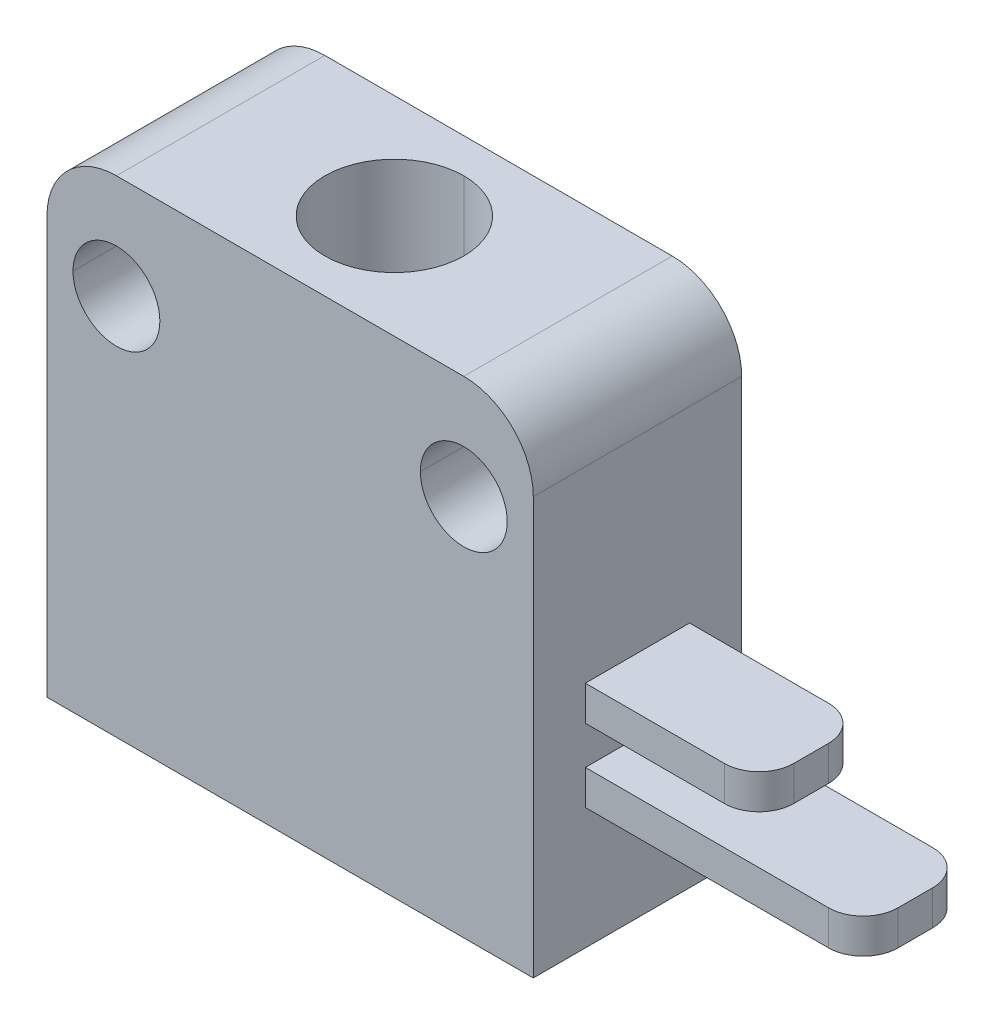
ISO-10303-21;
HEADER;
FILE_DESCRIPTION(('STEP AP214'),'2;1');
FILE_NAME('part.step','',(''),(''),'','','');
FILE_SCHEMA(('AUTOMOTIVE_DESIGN { 1 0 10303 214 1 1 1 1 }'));
ENDSEC;
DATA;
#1=APPLICATION_CONTEXT('core data for automotive mechanical design processes');
#2=APPLICATION_PROTOCOL_DEFINITION('international standard','automotive_design',2000,#1);
#3=PRODUCT_CONTEXT('',#1,'mechanical');
#4=PRODUCT('Part','Part','',(#3));
#5=PRODUCT_RELATED_PRODUCT_CATEGORY('part','',(#4));
#6=PRODUCT_DEFINITION_FORMATION('','',#4);
#7=PRODUCT_DEFINITION_CONTEXT('part definition',#1,'design');
#8=PRODUCT_DEFINITION('design','',#6,#7);
#9=PRODUCT_DEFINITION_SHAPE('','',#8);
#10=(LENGTH_UNIT() NAMED_UNIT(*) SI_UNIT(.MILLI.,.METRE.));
#11=(NAMED_UNIT(*) PLANE_ANGLE_UNIT() SI_UNIT($,.RADIAN.));
#12=(NAMED_UNIT(*) SI_UNIT($,.STERADIAN.) SOLID_ANGLE_UNIT());
#13=UNCERTAINTY_MEASURE_WITH_UNIT(LENGTH_MEASURE(1.E-05),#10,'distance_accuracy_value','');
#14=(GEOMETRIC_REPRESENTATION_CONTEXT(3) GLOBAL_UNCERTAINTY_ASSIGNED_CONTEXT((#13)) GLOBAL_UNIT_ASSIGNED_CONTEXT((#10,
#11,#12)) REPRESENTATION_CONTEXT('',''));
#15=CARTESIAN_POINT('',(0.,0.,0.));
#16=DIRECTION('',(0.,0.,1.));
#17=DIRECTION('',(1.,0.,0.));
#18=AXIS2_PLACEMENT_3D('',#15,#16,#17);
#19=CARTESIAN_POINT('',(11.,-7.4,-0.5));
#20=DIRECTION('',(0.,1.,0.));
#21=DIRECTION('',(-1.,0.,0.));
#22=AXIS2_PLACEMENT_3D('',#19,#20,#21);
#23=CYLINDRICAL_SURFACE('',#22,1.);
#24=CARTESIAN_POINT('',(11.,-8.4,-0.5));
#25=DIRECTION('',(0.,-1.,0.));
#26=DIRECTION('',(-1.,0.,0.));
#27=AXIS2_PLACEMENT_3D('',#24,#25,#26);
#28=CIRCLE('',#27,1.);
#29=CARTESIAN_POINT('',(11.,-8.4,-1.5));
#30=VERTEX_POINT('',#29);
#31=CARTESIAN_POINT('',(12.,-8.4,-0.5));
#32=VERTEX_POINT('',#31);
#33=EDGE_CURVE('E406',#30,#32,#28,.T.);
#34=ORIENTED_EDGE('',*,*,#33,.F.);
#35=DIRECTION('',(0.,-1.,0.));
#36=VECTOR('',#35,1.);
#37=CARTESIAN_POINT('',(11.,0.,-1.5));
#38=LINE('',#37,#36);
#39=CARTESIAN_POINT('',(11.,-7.4,-1.5));
#40=VERTEX_POINT('',#39);
#41=EDGE_CURVE('E265',#40,#30,#38,.T.);
#42=ORIENTED_EDGE('',*,*,#41,.F.);
#43=CARTESIAN_POINT('',(11.,-7.4,-0.5));
#44=DIRECTION('',(0.,1.,0.));
#45=DIRECTION('',(1.,0.,0.));
#46=AXIS2_PLACEMENT_3D('',#43,#44,#45);
#47=CIRCLE('',#46,1.);
#48=CARTESIAN_POINT('',(12.,-7.4,-0.5));
#49=VERTEX_POINT('',#48);
#50=EDGE_CURVE('E303',#49,#40,#47,.T.);
#51=ORIENTED_EDGE('',*,*,#50,.F.);
#52=DIRECTION('',(0.,1.,0.));
#53=VECTOR('',#52,1.);
#54=CARTESIAN_POINT('',(12.,-7.4,-0.5));
#55=LINE('',#54,#53);
#56=EDGE_CURVE('E361',#32,#49,#55,.T.);
#57=ORIENTED_EDGE('',*,*,#56,.F.);
#58=EDGE_LOOP('',(#34,#42,#51,#57));
#59=FACE_BOUND('',#58,.T.);
#60=ADVANCED_FACE('F17',(#59),#23,.T.);
#61=CARTESIAN_POINT('',(11.,0.,0.5));
#62=DIRECTION('',(0.,-1.,0.));
#63=DIRECTION('',(1.,0.,0.));
#64=AXIS2_PLACEMENT_3D('',#61,#62,#63);
#65=CYLINDRICAL_SURFACE('',#64,1.);
#66=CARTESIAN_POINT('',(11.,-8.4,0.5));
#67=DIRECTION('',(0.,-1.,0.));
#68=DIRECTION('',(-1.,0.,0.));
#69=AXIS2_PLACEMENT_3D('',#66,#67,#68);
#70=CIRCLE('',#69,1.);
#71=CARTESIAN_POINT('',(12.,-8.4,0.5));
#72=VERTEX_POINT('',#71);
#73=CARTESIAN_POINT('',(11.,-8.4,1.5));
#74=VERTEX_POINT('',#73);
#75=EDGE_CURVE('E399',#72,#74,#70,.T.);
#76=ORIENTED_EDGE('',*,*,#75,.F.);
#77=DIRECTION('',(0.,-1.,0.));
#78=VECTOR('',#77,1.);
#79=CARTESIAN_POINT('',(12.,-8.4,0.5));
#80=LINE('',#79,#78);
#81=CARTESIAN_POINT('',(12.,-7.4,0.5));
#82=VERTEX_POINT('',#81);
#83=EDGE_CURVE('E358',#82,#72,#80,.T.);
#84=ORIENTED_EDGE('',*,*,#83,.F.);
#85=CARTESIAN_POINT('',(11.,-7.4,0.5));
#86=DIRECTION('',(0.,1.,0.));
#87=DIRECTION('',(1.,0.,0.));
#88=AXIS2_PLACEMENT_3D('',#85,#86,#87);
#89=CIRCLE('',#88,1.);
#90=CARTESIAN_POINT('',(11.,-7.4,1.5));
#91=VERTEX_POINT('',#90);
#92=EDGE_CURVE('E307',#91,#82,#89,.T.);
#93=ORIENTED_EDGE('',*,*,#92,.F.);
#94=DIRECTION('',(0.,1.,0.));
#95=VECTOR('',#94,1.);
#96=CARTESIAN_POINT('',(11.,-7.4,1.5));
#97=LINE('',#96,#95);
#98=EDGE_CURVE('E262',#74,#91,#97,.T.);
#99=ORIENTED_EDGE('',*,*,#98,.F.);
#100=EDGE_LOOP('',(#76,#84,#93,#99));
#101=FACE_BOUND('',#100,.T.);
#102=ADVANCED_FACE('F521',(#101),#65,.T.);
#103=CARTESIAN_POINT('',(14.,-9.5,-0.5));
#104=DIRECTION('',(0.,1.,0.));
#105=DIRECTION('',(-1.,0.,0.));
#106=AXIS2_PLACEMENT_3D('',#103,#104,#105);
#107=CYLINDRICAL_SURFACE('',#106,1.);
#108=CARTESIAN_POINT('',(14.,-10.5,-0.5));
#109=DIRECTION('',(0.,-1.,0.));
#110=DIRECTION('',(0.,0.,1.));
#111=AXIS2_PLACEMENT_3D('',#108,#109,#110);
#112=CIRCLE('',#111,1.);
#113=CARTESIAN_POINT('',(14.,-10.5,-1.5));
#114=VERTEX_POINT('',#113);
#115=CARTESIAN_POINT('',(15.,-10.5,-0.5));
#116=VERTEX_POINT('',#115);
#117=EDGE_CURVE('E320',#114,#116,#112,.T.);
#118=ORIENTED_EDGE('',*,*,#117,.F.);
#119=DIRECTION('',(0.,-1.,0.));
#120=VECTOR('',#119,1.);
#121=CARTESIAN_POINT('',(14.,0.,-1.5));
#122=LINE('',#121,#120);
#123=CARTESIAN_POINT('',(14.,-9.5,-1.5));
#124=VERTEX_POINT('',#123);
#125=EDGE_CURVE('E26',#124,#114,#122,.T.);
#126=ORIENTED_EDGE('',*,*,#125,.F.);
#127=CARTESIAN_POINT('',(14.,-9.5,-0.5));
#128=DIRECTION('',(0.,1.,0.));
#129=DIRECTION('',(0.,0.,-1.));
#130=AXIS2_PLACEMENT_3D('',#127,#128,#129);
#131=CIRCLE('',#130,1.);
#132=CARTESIAN_POINT('',(15.,-9.5,-0.5));
#133=VERTEX_POINT('',#132);
#134=EDGE_CURVE('E487',#133,#124,#131,.T.);
#135=ORIENTED_EDGE('',*,*,#134,.F.);
#136=DIRECTION('',(0.,1.,0.));
#137=VECTOR('',#136,1.);
#138=CARTESIAN_POINT('',(15.,-9.5,-0.5));
#139=LINE('',#138,#137);
#140=EDGE_CURVE('E453',#116,#133,#139,.T.);
#141=ORIENTED_EDGE('',*,*,#140,.F.);
#142=EDGE_LOOP('',(#118,#126,#135,#141));
#143=FACE_BOUND('',#142,.T.);
#144=ADVANCED_FACE('F519',(#143),#107,.T.);
#145=CARTESIAN_POINT('',(14.,0.,0.5));
#146=DIRECTION('',(0.,-1.,0.));
#147=DIRECTION('',(1.,0.,0.));
#148=AXIS2_PLACEMENT_3D('',#145,#146,#147);
#149=CYLINDRICAL_SURFACE('',#148,1.);
#150=CARTESIAN_POINT('',(14.,-10.5,0.5));
#151=DIRECTION('',(0.,-1.,0.));
#152=DIRECTION('',(0.,0.,1.));
#153=AXIS2_PLACEMENT_3D('',#150,#151,#152);
#154=CIRCLE('',#153,1.);
#155=CARTESIAN_POINT('',(15.,-10.5,0.5));
#156=VERTEX_POINT('',#155);
#157=CARTESIAN_POINT('',(14.,-10.5,1.5));
#158=VERTEX_POINT('',#157);
#159=EDGE_CURVE('E441',#156,#158,#154,.T.);
#160=ORIENTED_EDGE('',*,*,#159,.F.);
#161=DIRECTION('',(0.,-1.,0.));
#162=VECTOR('',#161,1.);
#163=CARTESIAN_POINT('',(15.,-10.5,0.5));
#164=LINE('',#163,#162);
#165=CARTESIAN_POINT('',(15.,-9.5,0.5));
#166=VERTEX_POINT('',#165);
#167=EDGE_CURVE('E450',#166,#156,#164,.T.);
#168=ORIENTED_EDGE('',*,*,#167,.F.);
#169=CARTESIAN_POINT('',(14.,-9.5,0.5));
#170=DIRECTION('',(0.,1.,0.));
#171=DIRECTION('',(0.,0.,-1.));
#172=AXIS2_PLACEMENT_3D('',#169,#170,#171);
#173=CIRCLE('',#172,1.);
#174=CARTESIAN_POINT('',(14.,-9.5,1.5));
#175=VERTEX_POINT('',#174);
#176=EDGE_CURVE('E484',#175,#166,#173,.T.);
#177=ORIENTED_EDGE('',*,*,#176,.F.);
#178=DIRECTION('',(0.,1.,0.));
#179=VECTOR('',#178,1.);
#180=CARTESIAN_POINT('',(14.,-9.5,1.5));
#181=LINE('',#180,#179);
#182=EDGE_CURVE('E336',#158,#175,#181,.T.);
#183=ORIENTED_EDGE('',*,*,#182,.F.);
#184=EDGE_LOOP('',(#160,#168,#177,#183));
#185=FACE_BOUND('',#184,.T.);
#186=ADVANCED_FACE('F504',(#185),#149,.T.);
#187=CARTESIAN_POINT('',(5.,-2.,3.));
#188=DIRECTION('',(0.,0.,-1.));
#189=DIRECTION('',(-1.,0.,0.));
#190=AXIS2_PLACEMENT_3D('',#187,#188,#189);
#191=CYLINDRICAL_SURFACE('',#190,2.);
#192=CARTESIAN_POINT('',(5.,-2.,3.));
#193=DIRECTION('',(0.,0.,1.));
#194=DIRECTION('',(1.,0.,0.));
#195=AXIS2_PLACEMENT_3D('',#192,#193,#194);
#196=CIRCLE('',#195,2.);
#197=CARTESIAN_POINT('',(7.,-2.,3.));
#198=VERTEX_POINT('',#197);
#199=CARTESIAN_POINT('',(5.,0.,3.));
#200=VERTEX_POINT('',#199);
#201=EDGE_CURVE('E270',#198,#200,#196,.T.);
#202=ORIENTED_EDGE('',*,*,#201,.F.);
#203=DIRECTION('',(0.,0.,1.));
#204=VECTOR('',#203,1.);
#205=CARTESIAN_POINT('',(7.,-2.,3.));
#206=LINE('',#205,#204);
#207=CARTESIAN_POINT('',(7.,-2.,-3.));
#208=VERTEX_POINT('',#207);
#209=EDGE_CURVE('E370',#208,#198,#206,.T.);
#210=ORIENTED_EDGE('',*,*,#209,.F.);
#211=CARTESIAN_POINT('',(5.,-2.,-3.));
#212=DIRECTION('',(0.,0.,-1.));
#213=DIRECTION('',(1.,0.,0.));
#214=AXIS2_PLACEMENT_3D('',#211,#212,#213);
#215=CIRCLE('',#214,2.);
#216=CARTESIAN_POINT('',(5.,0.,-3.));
#217=VERTEX_POINT('',#216);
#218=EDGE_CURVE('E357',#217,#208,#215,.T.);
#219=ORIENTED_EDGE('',*,*,#218,.F.);
#220=DIRECTION('',(0.,0.,-1.));
#221=VECTOR('',#220,1.);
#222=CARTESIAN_POINT('',(5.,0.,3.));
#223=LINE('',#222,#221);
#224=EDGE_CURVE('E390',#200,#217,#223,.T.);
#225=ORIENTED_EDGE('',*,*,#224,.F.);
#226=EDGE_LOOP('',(#202,#210,#219,#225));
#227=FACE_BOUND('',#226,.T.);
#228=ADVANCED_FACE('F527',(#227),#191,.T.);
#229=CARTESIAN_POINT('',(-5.,-2.,3.));
#230=DIRECTION('',(0.,0.,-1.));
#231=DIRECTION('',(-1.,0.,0.));
#232=AXIS2_PLACEMENT_3D('',#229,#230,#231);
#233=CYLINDRICAL_SURFACE('',#232,2.);
#234=CARTESIAN_POINT('',(-5.,-2.,3.));
#235=DIRECTION('',(0.,0.,1.));
#236=DIRECTION('',(1.,0.,0.));
#237=AXIS2_PLACEMENT_3D('',#234,#235,#236);
#238=CIRCLE('',#237,2.);
#239=CARTESIAN_POINT('',(-5.,0.,3.));
#240=VERTEX_POINT('',#239);
#241=CARTESIAN_POINT('',(-7.,-2.,3.));
#242=VERTEX_POINT('',#241);
#243=EDGE_CURVE('E261',#240,#242,#238,.T.);
#244=ORIENTED_EDGE('',*,*,#243,.F.);
#245=DIRECTION('',(0.,0.,1.));
#246=VECTOR('',#245,1.);
#247=CARTESIAN_POINT('',(-5.,0.,3.));
#248=LINE('',#247,#246);
#249=CARTESIAN_POINT('',(-5.,0.,-3.));
#250=VERTEX_POINT('',#249);
#251=EDGE_CURVE('E387',#250,#240,#248,.T.);
#252=ORIENTED_EDGE('',*,*,#251,.F.);
#253=CARTESIAN_POINT('',(-5.,-2.,-3.));
#254=DIRECTION('',(0.,0.,-1.));
#255=DIRECTION('',(1.,0.,0.));
#256=AXIS2_PLACEMENT_3D('',#253,#254,#255);
#257=CIRCLE('',#256,2.);
#258=CARTESIAN_POINT('',(-7.,-2.,-3.));
#259=VERTEX_POINT('',#258);
#260=EDGE_CURVE('E349',#259,#250,#257,.T.);
#261=ORIENTED_EDGE('',*,*,#260,.F.);
#262=DIRECTION('',(0.,0.,-1.));
#263=VECTOR('',#262,1.);
#264=CARTESIAN_POINT('',(-7.,-2.,3.));
#265=LINE('',#264,#263);
#266=EDGE_CURVE('E330',#242,#259,#265,.T.);
#267=ORIENTED_EDGE('',*,*,#266,.F.);
#268=EDGE_LOOP('',(#244,#252,#261,#267));
#269=FACE_BOUND('',#268,.T.);
#270=ADVANCED_FACE('F596',(#269),#233,.T.);
#271=CARTESIAN_POINT('',(0.,-4.,0.));
#272=DIRECTION('',(0.,1.,0.));
#273=DIRECTION('',(1.,0.,0.));
#274=AXIS2_PLACEMENT_3D('',#271,#272,#273);
#275=PLANE('',#274);
#276=CARTESIAN_POINT('',(0.,-4.,0.));
#277=DIRECTION('',(0.,1.,0.));
#278=DIRECTION('',(0.,0.,1.));
#279=AXIS2_PLACEMENT_3D('',#276,#277,#278);
#280=CIRCLE('',#279,2.);
#281=CARTESIAN_POINT('',(0.,-4.,2.));
#282=VERTEX_POINT('',#281);
#283=CARTESIAN_POINT('',(0.,-4.,-2.));
#284=VERTEX_POINT('',#283);
#285=EDGE_CURVE('E11',#282,#284,#280,.T.);
#286=ORIENTED_EDGE('',*,*,#285,.T.);
#287=CARTESIAN_POINT('',(0.,-4.,0.));
#288=DIRECTION('',(0.,1.,0.));
#289=DIRECTION('',(0.,0.,1.));
#290=AXIS2_PLACEMENT_3D('',#287,#288,#289);
#291=CIRCLE('',#290,2.);
#292=EDGE_CURVE('E228',#284,#282,#291,.T.);
#293=ORIENTED_EDGE('',*,*,#292,.T.);
#294=EDGE_LOOP('',(#286,#293));
#295=FACE_BOUND('',#294,.T.);
#296=ADVANCED_FACE('F226',(#295),#275,.T.);
#297=CARTESIAN_POINT('',(0.,-4.,0.));
#298=DIRECTION('',(0.,1.,0.));
#299=DIRECTION('',(0.,0.,1.));
#300=AXIS2_PLACEMENT_3D('',#297,#298,#299);
#301=CYLINDRICAL_SURFACE('',#300,2.);
#302=DIRECTION('',(0.,1.,0.));
#303=VECTOR('',#302,1.);
#304=CARTESIAN_POINT('',(0.,-4.,-2.));
#305=LINE('',#304,#303);
#306=CARTESIAN_POINT('',(0.,0.,-2.));
#307=VERTEX_POINT('',#306);
#308=EDGE_CURVE('E233',#284,#307,#305,.T.);
#309=ORIENTED_EDGE('',*,*,#308,.F.);
#310=ORIENTED_EDGE('',*,*,#285,.F.);
#311=DIRECTION('',(0.,1.,0.));
#312=VECTOR('',#311,1.);
#313=CARTESIAN_POINT('',(0.,-4.,2.));
#314=LINE('',#313,#312);
#315=CARTESIAN_POINT('',(0.,0.,2.));
#316=VERTEX_POINT('',#315);
#317=EDGE_CURVE('E243',#282,#316,#314,.T.);
#318=ORIENTED_EDGE('',*,*,#317,.T.);
#319=CARTESIAN_POINT('',(0.,0.,0.));
#320=DIRECTION('',(0.,1.,0.));
#321=DIRECTION('',(0.,0.,1.));
#322=AXIS2_PLACEMENT_3D('',#319,#320,#321);
#323=CIRCLE('',#322,2.);
#324=EDGE_CURVE('E235',#316,#307,#323,.T.);
#325=ORIENTED_EDGE('',*,*,#324,.T.);
#326=EDGE_LOOP('',(#309,#310,#318,#325));
#327=FACE_BOUND('',#326,.T.);
#328=ADVANCED_FACE('F234',(#327),#301,.F.);
#329=CARTESIAN_POINT('',(0.,0.,-1.5));
#330=DIRECTION('',(0.,0.,1.));
#331=DIRECTION('',(1.,0.,0.));
#332=AXIS2_PLACEMENT_3D('',#329,#330,#331);
#333=PLANE('',#332);
#334=DIRECTION('',(-1.,0.,0.));
#335=VECTOR('',#334,1.);
#336=CARTESIAN_POINT('',(7.,-9.5,-1.5));
#337=LINE('',#336,#335);
#338=CARTESIAN_POINT('',(7.,-9.5,-1.5));
#339=VERTEX_POINT('',#338);
#340=EDGE_CURVE('E491',#124,#339,#337,.T.);
#341=ORIENTED_EDGE('',*,*,#340,.F.);
#342=ORIENTED_EDGE('',*,*,#125,.T.);
#343=DIRECTION('',(1.,0.,0.));
#344=VECTOR('',#343,1.);
#345=CARTESIAN_POINT('',(7.,-10.5,-1.5));
#346=LINE('',#345,#344);
#347=CARTESIAN_POINT('',(7.,-10.5,-1.5));
#348=VERTEX_POINT('',#347);
#349=EDGE_CURVE('E325',#348,#114,#346,.T.);
#350=ORIENTED_EDGE('',*,*,#349,.F.);
#351=DIRECTION('',(0.,-1.,0.));
#352=VECTOR('',#351,1.);
#353=CARTESIAN_POINT('',(7.,-9.5,-1.5));
#354=LINE('',#353,#352);
#355=EDGE_CURVE('E285',#339,#348,#354,.T.);
#356=ORIENTED_EDGE('',*,*,#355,.F.);
#357=EDGE_LOOP('',(#341,#342,#350,#356));
#358=FACE_BOUND('',#357,.T.);
#359=ADVANCED_FACE('F588',(#358),#333,.F.);
#360=CARTESIAN_POINT('',(0.,0.,1.5));
#361=DIRECTION('',(0.,0.,1.));
#362=DIRECTION('',(1.,0.,0.));
#363=AXIS2_PLACEMENT_3D('',#360,#361,#362);
#364=PLANE('',#363);
#365=DIRECTION('',(1.,0.,0.));
#366=VECTOR('',#365,1.);
#367=CARTESIAN_POINT('',(7.,-10.5,1.5));
#368=LINE('',#367,#366);
#369=CARTESIAN_POINT('',(7.,-10.5,1.5));
#370=VERTEX_POINT('',#369);
#371=EDGE_CURVE('E445',#370,#158,#368,.T.);
#372=ORIENTED_EDGE('',*,*,#371,.T.);
#373=ORIENTED_EDGE('',*,*,#182,.T.);
#374=DIRECTION('',(-1.,0.,0.));
#375=VECTOR('',#374,1.);
#376=CARTESIAN_POINT('',(7.,-9.5,1.5));
#377=LINE('',#376,#375);
#378=CARTESIAN_POINT('',(7.,-9.5,1.5));
#379=VERTEX_POINT('',#378);
#380=EDGE_CURVE('E481',#175,#379,#377,.T.);
#381=ORIENTED_EDGE('',*,*,#380,.T.);
#382=DIRECTION('',(0.,-1.,0.));
#383=VECTOR('',#382,1.);
#384=CARTESIAN_POINT('',(7.,-9.5,1.5));
#385=LINE('',#384,#383);
#386=EDGE_CURVE('E405',#379,#370,#385,.T.);
#387=ORIENTED_EDGE('',*,*,#386,.T.);
#388=EDGE_LOOP('',(#372,#373,#381,#387));
#389=FACE_BOUND('',#388,.T.);
#390=ADVANCED_FACE('F498',(#389),#364,.T.);
#391=CARTESIAN_POINT('',(7.,-9.5,1.5));
#392=DIRECTION('',(0.,-1.,0.));
#393=DIRECTION('',(0.,0.,-1.));
#394=AXIS2_PLACEMENT_3D('',#391,#392,#393);
#395=PLANE('',#394);
#396=ORIENTED_EDGE('',*,*,#380,.F.);
#397=ORIENTED_EDGE('',*,*,#176,.T.);
#398=DIRECTION('',(0.,0.,-1.));
#399=VECTOR('',#398,1.);
#400=CARTESIAN_POINT('',(15.,-9.5,1.5));
#401=LINE('',#400,#399);
#402=EDGE_CURVE('E324',#166,#133,#401,.T.);
#403=ORIENTED_EDGE('',*,*,#402,.T.);
#404=ORIENTED_EDGE('',*,*,#134,.T.);
#405=ORIENTED_EDGE('',*,*,#340,.T.);
#406=DIRECTION('',(0.,0.,-1.));
#407=VECTOR('',#406,1.);
#408=CARTESIAN_POINT('',(7.,-9.5,1.5));
#409=LINE('',#408,#407);
#410=EDGE_CURVE('E290',#379,#339,#409,.T.);
#411=ORIENTED_EDGE('',*,*,#410,.F.);
#412=EDGE_LOOP('',(#396,#397,#403,#404,#405,#411));
#413=FACE_BOUND('',#412,.T.);
#414=ADVANCED_FACE('F507',(#413),#395,.F.);
#415=CARTESIAN_POINT('',(15.,-9.5,1.5));
#416=DIRECTION('',(-1.,0.,0.));
#417=DIRECTION('',(0.,1.,0.));
#418=AXIS2_PLACEMENT_3D('',#415,#416,#417);
#419=PLANE('',#418);
#420=ORIENTED_EDGE('',*,*,#402,.F.);
#421=ORIENTED_EDGE('',*,*,#167,.T.);
#422=DIRECTION('',(0.,0.,-1.));
#423=VECTOR('',#422,1.);
#424=CARTESIAN_POINT('',(15.,-10.5,1.5));
#425=LINE('',#424,#423);
#426=EDGE_CURVE('E446',#156,#116,#425,.T.);
#427=ORIENTED_EDGE('',*,*,#426,.T.);
#428=ORIENTED_EDGE('',*,*,#140,.T.);
#429=EDGE_LOOP('',(#420,#421,#427,#428));
#430=FACE_BOUND('',#429,.T.);
#431=ADVANCED_FACE('F518',(#430),#419,.F.);
#432=CARTESIAN_POINT('',(7.,-10.5,1.5));
#433=DIRECTION('',(0.,1.,0.));
#434=DIRECTION('',(1.,0.,0.));
#435=AXIS2_PLACEMENT_3D('',#432,#433,#434);
#436=PLANE('',#435);
#437=ORIENTED_EDGE('',*,*,#426,.F.);
#438=ORIENTED_EDGE('',*,*,#159,.T.);
#439=ORIENTED_EDGE('',*,*,#371,.F.);
#440=DIRECTION('',(0.,0.,-1.));
#441=VECTOR('',#440,1.);
#442=CARTESIAN_POINT('',(7.,-10.5,1.5));
#443=LINE('',#442,#441);
#444=EDGE_CURVE('E373',#370,#348,#443,.T.);
#445=ORIENTED_EDGE('',*,*,#444,.T.);
#446=ORIENTED_EDGE('',*,*,#349,.T.);
#447=ORIENTED_EDGE('',*,*,#117,.T.);
#448=EDGE_LOOP('',(#437,#438,#439,#445,#446,#447));
#449=FACE_BOUND('',#448,.T.);
#450=ADVANCED_FACE('F516',(#449),#436,.F.);
#451=CARTESIAN_POINT('',(0.,0.,-1.5));
#452=DIRECTION('',(0.,0.,1.));
#453=DIRECTION('',(1.,0.,0.));
#454=AXIS2_PLACEMENT_3D('',#451,#452,#453);
#455=PLANE('',#454);
#456=DIRECTION('',(-1.,0.,0.));
#457=VECTOR('',#456,1.);
#458=CARTESIAN_POINT('',(7.,-7.4,-1.5));
#459=LINE('',#458,#457);
#460=CARTESIAN_POINT('',(7.,-7.4,-1.5));
#461=VERTEX_POINT('',#460);
#462=EDGE_CURVE('E266',#40,#461,#459,.T.);
#463=ORIENTED_EDGE('',*,*,#462,.F.);
#464=ORIENTED_EDGE('',*,*,#41,.T.);
#465=DIRECTION('',(1.,0.,0.));
#466=VECTOR('',#465,1.);
#467=CARTESIAN_POINT('',(7.,-8.4,-1.5));
#468=LINE('',#467,#466);
#469=CARTESIAN_POINT('',(7.,-8.4,-1.5));
#470=VERTEX_POINT('',#469);
#471=EDGE_CURVE('E398',#470,#30,#468,.T.);
#472=ORIENTED_EDGE('',*,*,#471,.F.);
#473=DIRECTION('',(0.,-1.,0.));
#474=VECTOR('',#473,1.);
#475=CARTESIAN_POINT('',(7.,-7.4,-1.5));
#476=LINE('',#475,#474);
#477=EDGE_CURVE('E423',#461,#470,#476,.T.);
#478=ORIENTED_EDGE('',*,*,#477,.F.);
#479=EDGE_LOOP('',(#463,#464,#472,#478));
#480=FACE_BOUND('',#479,.T.);
#481=ADVANCED_FACE('F543',(#480),#455,.F.);
#482=CARTESIAN_POINT('',(0.,0.,1.5));
#483=DIRECTION('',(0.,0.,1.));
#484=DIRECTION('',(1.,0.,0.));
#485=AXIS2_PLACEMENT_3D('',#482,#483,#484);
#486=PLANE('',#485);
#487=DIRECTION('',(1.,0.,0.));
#488=VECTOR('',#487,1.);
#489=CARTESIAN_POINT('',(7.,-8.4,1.5));
#490=LINE('',#489,#488);
#491=CARTESIAN_POINT('',(7.,-8.4,1.5));
#492=VERTEX_POINT('',#491);
#493=EDGE_CURVE('E394',#492,#74,#490,.T.);
#494=ORIENTED_EDGE('',*,*,#493,.T.);
#495=ORIENTED_EDGE('',*,*,#98,.T.);
#496=DIRECTION('',(-1.,0.,0.));
#497=VECTOR('',#496,1.);
#498=CARTESIAN_POINT('',(7.,-7.4,1.5));
#499=LINE('',#498,#497);
#500=CARTESIAN_POINT('',(7.,-7.4,1.5));
#501=VERTEX_POINT('',#500);
#502=EDGE_CURVE('E367',#91,#501,#499,.T.);
#503=ORIENTED_EDGE('',*,*,#502,.T.);
#504=DIRECTION('',(0.,-1.,0.));
#505=VECTOR('',#504,1.);
#506=CARTESIAN_POINT('',(7.,-7.4,1.5));
#507=LINE('',#506,#505);
#508=EDGE_CURVE('E391',#501,#492,#507,.T.);
#509=ORIENTED_EDGE('',*,*,#508,.T.);
#510=EDGE_LOOP('',(#494,#495,#503,#509));
#511=FACE_BOUND('',#510,.T.);
#512=ADVANCED_FACE('F555',(#511),#486,.T.);
#513=CARTESIAN_POINT('',(7.,-7.4,1.5));
#514=DIRECTION('',(0.,-1.,0.));
#515=DIRECTION('',(0.,0.,-1.));
#516=AXIS2_PLACEMENT_3D('',#513,#514,#515);
#517=PLANE('',#516);
#518=ORIENTED_EDGE('',*,*,#502,.F.);
#519=ORIENTED_EDGE('',*,*,#92,.T.);
#520=DIRECTION('',(0.,0.,-1.));
#521=VECTOR('',#520,1.);
#522=CARTESIAN_POINT('',(12.,-7.4,1.5));
#523=LINE('',#522,#521);
#524=EDGE_CURVE('E362',#82,#49,#523,.T.);
#525=ORIENTED_EDGE('',*,*,#524,.T.);
#526=ORIENTED_EDGE('',*,*,#50,.T.);
#527=ORIENTED_EDGE('',*,*,#462,.T.);
#528=DIRECTION('',(0.,0.,-1.));
#529=VECTOR('',#528,1.);
#530=CARTESIAN_POINT('',(7.,-7.4,1.5));
#531=LINE('',#530,#529);
#532=EDGE_CURVE('E289',#501,#461,#531,.T.);
#533=ORIENTED_EDGE('',*,*,#532,.F.);
#534=EDGE_LOOP('',(#518,#519,#525,#526,#527,#533));
#535=FACE_BOUND('',#534,.T.);
#536=ADVANCED_FACE('F547',(#535),#517,.F.);
#537=CARTESIAN_POINT('',(12.,-7.4,1.5));
#538=DIRECTION('',(-1.,0.,0.));
#539=DIRECTION('',(0.,1.,0.));
#540=AXIS2_PLACEMENT_3D('',#537,#538,#539);
#541=PLANE('',#540);
#542=ORIENTED_EDGE('',*,*,#524,.F.);
#543=ORIENTED_EDGE('',*,*,#83,.T.);
#544=DIRECTION('',(0.,0.,-1.));
#545=VECTOR('',#544,1.);
#546=CARTESIAN_POINT('',(12.,-8.4,1.5));
#547=LINE('',#546,#545);
#548=EDGE_CURVE('E416',#72,#32,#547,.T.);
#549=ORIENTED_EDGE('',*,*,#548,.T.);
#550=ORIENTED_EDGE('',*,*,#56,.T.);
#551=EDGE_LOOP('',(#542,#543,#549,#550));
#552=FACE_BOUND('',#551,.T.);
#553=ADVANCED_FACE('F550',(#552),#541,.F.);
#554=CARTESIAN_POINT('',(7.,-8.4,1.5));
#555=DIRECTION('',(0.,1.,0.));
#556=DIRECTION('',(1.,0.,0.));
#557=AXIS2_PLACEMENT_3D('',#554,#555,#556);
#558=PLANE('',#557);
#559=ORIENTED_EDGE('',*,*,#548,.F.);
#560=ORIENTED_EDGE('',*,*,#75,.T.);
#561=ORIENTED_EDGE('',*,*,#493,.F.);
#562=DIRECTION('',(0.,0.,-1.));
#563=VECTOR('',#562,1.);
#564=CARTESIAN_POINT('',(7.,-8.4,1.5));
#565=LINE('',#564,#563);
#566=EDGE_CURVE('E427',#492,#470,#565,.T.);
#567=ORIENTED_EDGE('',*,*,#566,.T.);
#568=ORIENTED_EDGE('',*,*,#471,.T.);
#569=ORIENTED_EDGE('',*,*,#33,.T.);
#570=EDGE_LOOP('',(#559,#560,#561,#567,#568,#569));
#571=FACE_BOUND('',#570,.T.);
#572=ADVANCED_FACE('F539',(#571),#558,.F.);
#573=CARTESIAN_POINT('',(5.,-3.,3.));
#574=DIRECTION('',(0.,0.,-1.));
#575=DIRECTION('',(-1.,0.,0.));
#576=AXIS2_PLACEMENT_3D('',#573,#574,#575);
#577=CYLINDRICAL_SURFACE('',#576,1.25);
#578=DIRECTION('',(0.,0.,-1.));
#579=VECTOR('',#578,1.);
#580=CARTESIAN_POINT('',(6.25,-3.,3.));
#581=LINE('',#580,#579);
#582=CARTESIAN_POINT('',(6.25,-3.,3.));
#583=VERTEX_POINT('',#582);
#584=CARTESIAN_POINT('',(6.25,-3.,-3.));
#585=VERTEX_POINT('',#584);
#586=EDGE_CURVE('E279',#583,#585,#581,.T.);
#587=ORIENTED_EDGE('',*,*,#586,.F.);
#588=CARTESIAN_POINT('',(5.,-3.,3.));
#589=DIRECTION('',(0.,0.,1.));
#590=DIRECTION('',(1.,0.,0.));
#591=AXIS2_PLACEMENT_3D('',#588,#589,#590);
#592=CIRCLE('',#591,1.25);
#593=CARTESIAN_POINT('',(3.75,-3.,3.));
#594=VERTEX_POINT('',#593);
#595=EDGE_CURVE('E342',#583,#594,#592,.T.);
#596=ORIENTED_EDGE('',*,*,#595,.T.);
#597=DIRECTION('',(0.,0.,-1.));
#598=VECTOR('',#597,1.);
#599=CARTESIAN_POINT('',(3.75,-3.,3.));
#600=LINE('',#599,#598);
#601=CARTESIAN_POINT('',(3.75,-3.,-3.));
#602=VERTEX_POINT('',#601);
#603=EDGE_CURVE('E284',#594,#602,#600,.T.);
#604=ORIENTED_EDGE('',*,*,#603,.T.);
#605=CARTESIAN_POINT('',(5.,-3.,-3.));
#606=DIRECTION('',(0.,0.,1.));
#607=DIRECTION('',(1.,0.,0.));
#608=AXIS2_PLACEMENT_3D('',#605,#606,#607);
#609=CIRCLE('',#608,1.25);
#610=EDGE_CURVE('E384',#585,#602,#609,.T.);
#611=ORIENTED_EDGE('',*,*,#610,.F.);
#612=EDGE_LOOP('',(#587,#596,#604,#611));
#613=FACE_BOUND('',#612,.T.);
#614=ADVANCED_FACE('F576',(#613),#577,.F.);
#615=CARTESIAN_POINT('',(-5.,-3.,3.));
#616=DIRECTION('',(0.,0.,-1.));
#617=DIRECTION('',(-1.,0.,0.));
#618=AXIS2_PLACEMENT_3D('',#615,#616,#617);
#619=CYLINDRICAL_SURFACE('',#618,1.25);
#620=DIRECTION('',(0.,0.,-1.));
#621=VECTOR('',#620,1.);
#622=CARTESIAN_POINT('',(-3.75,-3.,3.));
#623=LINE('',#622,#621);
#624=CARTESIAN_POINT('',(-3.75,-3.,3.));
#625=VERTEX_POINT('',#624);
#626=CARTESIAN_POINT('',(-3.75,-3.,-3.));
#627=VERTEX_POINT('',#626);
#628=EDGE_CURVE('E256',#625,#627,#623,.T.);
#629=ORIENTED_EDGE('',*,*,#628,.F.);
#630=CARTESIAN_POINT('',(-5.,-3.,3.));
#631=DIRECTION('',(0.,0.,1.));
#632=DIRECTION('',(1.,0.,0.));
#633=AXIS2_PLACEMENT_3D('',#630,#631,#632);
#634=CIRCLE('',#633,1.25);
#635=CARTESIAN_POINT('',(-6.25,-3.,3.));
#636=VERTEX_POINT('',#635);
#637=EDGE_CURVE('E274',#625,#636,#634,.T.);
#638=ORIENTED_EDGE('',*,*,#637,.T.);
#639=DIRECTION('',(0.,0.,-1.));
#640=VECTOR('',#639,1.);
#641=CARTESIAN_POINT('',(-6.25,-3.,3.));
#642=LINE('',#641,#640);
#643=CARTESIAN_POINT('',(-6.25,-3.,-3.));
#644=VERTEX_POINT('',#643);
#645=EDGE_CURVE('E255',#636,#644,#642,.T.);
#646=ORIENTED_EDGE('',*,*,#645,.T.);
#647=CARTESIAN_POINT('',(-5.,-3.,-3.));
#648=DIRECTION('',(0.,0.,1.));
#649=DIRECTION('',(1.,0.,0.));
#650=AXIS2_PLACEMENT_3D('',#647,#648,#649);
#651=CIRCLE('',#650,1.25);
#652=EDGE_CURVE('E381',#627,#644,#651,.T.);
#653=ORIENTED_EDGE('',*,*,#652,.F.);
#654=EDGE_LOOP('',(#629,#638,#646,#653));
#655=FACE_BOUND('',#654,.T.);
#656=ADVANCED_FACE('F569',(#655),#619,.F.);
#657=CARTESIAN_POINT('',(-7.,0.,3.));
#658=DIRECTION('',(0.,-1.,0.));
#659=DIRECTION('',(0.,0.,-1.));
#660=AXIS2_PLACEMENT_3D('',#657,#658,#659);
#661=PLANE('',#660);
#662=ORIENTED_EDGE('',*,*,#324,.F.);
#663=CARTESIAN_POINT('',(0.,0.,0.));
#664=DIRECTION('',(0.,1.,0.));
#665=DIRECTION('',(0.,0.,1.));
#666=AXIS2_PLACEMENT_3D('',#663,#664,#665);
#667=CIRCLE('',#666,2.);
#668=EDGE_CURVE('E240',#307,#316,#667,.T.);
#669=ORIENTED_EDGE('',*,*,#668,.F.);
#670=EDGE_LOOP('',(#662,#669));
#671=FACE_BOUND('',#670,.T.);
#672=DIRECTION('',(-1.,0.,0.));
#673=VECTOR('',#672,1.);
#674=CARTESIAN_POINT('',(-7.,0.,-3.));
#675=LINE('',#674,#673);
#676=EDGE_CURVE('E353',#217,#250,#675,.T.);
#677=ORIENTED_EDGE('',*,*,#676,.T.);
#678=ORIENTED_EDGE('',*,*,#251,.T.);
#679=DIRECTION('',(-1.,0.,0.));
#680=VECTOR('',#679,1.);
#681=CARTESIAN_POINT('',(-7.,0.,3.));
#682=LINE('',#681,#680);
#683=EDGE_CURVE('E257',#200,#240,#682,.T.);
#684=ORIENTED_EDGE('',*,*,#683,.F.);
#685=ORIENTED_EDGE('',*,*,#224,.T.);
#686=EDGE_LOOP('',(#677,#678,#684,#685));
#687=FACE_BOUND('',#686,.T.);
#688=ADVANCED_FACE('F560',(#671,#687),#661,.F.);
#689=CARTESIAN_POINT('',(7.,0.,3.));
#690=DIRECTION('',(-1.,0.,0.));
#691=DIRECTION('',(0.,0.,1.));
#692=AXIS2_PLACEMENT_3D('',#689,#690,#691);
#693=PLANE('',#692);
#694=ORIENTED_EDGE('',*,*,#532,.T.);
#695=ORIENTED_EDGE('',*,*,#477,.T.);
#696=ORIENTED_EDGE('',*,*,#566,.F.);
#697=ORIENTED_EDGE('',*,*,#508,.F.);
#698=EDGE_LOOP('',(#694,#695,#696,#697));
#699=FACE_BOUND('',#698,.T.);
#700=ORIENTED_EDGE('',*,*,#444,.F.);
#701=ORIENTED_EDGE('',*,*,#386,.F.);
#702=ORIENTED_EDGE('',*,*,#410,.T.);
#703=ORIENTED_EDGE('',*,*,#355,.T.);
#704=EDGE_LOOP('',(#700,#701,#702,#703));
#705=FACE_BOUND('',#704,.T.);
#706=DIRECTION('',(0.,1.,0.));
#707=VECTOR('',#706,1.);
#708=CARTESIAN_POINT('',(7.,0.,-3.));
#709=LINE('',#708,#707);
#710=CARTESIAN_POINT('',(7.,-14.,-3.));
#711=VERTEX_POINT('',#710);
#712=EDGE_CURVE('E366',#711,#208,#709,.T.);
#713=ORIENTED_EDGE('',*,*,#712,.T.);
#714=ORIENTED_EDGE('',*,*,#209,.T.);
#715=DIRECTION('',(0.,1.,0.));
#716=VECTOR('',#715,1.);
#717=CARTESIAN_POINT('',(7.,0.,3.));
#718=LINE('',#717,#716);
#719=CARTESIAN_POINT('',(7.,-14.,3.));
#720=VERTEX_POINT('',#719);
#721=EDGE_CURVE('E275',#720,#198,#718,.T.);
#722=ORIENTED_EDGE('',*,*,#721,.F.);
#723=DIRECTION('',(0.,0.,-1.));
#724=VECTOR('',#723,1.);
#725=CARTESIAN_POINT('',(7.,-14.,3.));
#726=LINE('',#725,#724);
#727=EDGE_CURVE('E329',#720,#711,#726,.T.);
#728=ORIENTED_EDGE('',*,*,#727,.T.);
#729=EDGE_LOOP('',(#713,#714,#722,#728));
#730=FACE_BOUND('',#729,.T.);
#731=ADVANCED_FACE('F512',(#699,#705,#730),#693,.F.);
#732=CARTESIAN_POINT('',(-7.,-14.,3.));
#733=DIRECTION('',(0.,1.,0.));
#734=DIRECTION('',(1.,0.,0.));
#735=AXIS2_PLACEMENT_3D('',#732,#733,#734);
#736=PLANE('',#735);
#737=DIRECTION('',(1.,0.,0.));
#738=VECTOR('',#737,1.);
#739=CARTESIAN_POINT('',(-7.,-14.,-3.));
#740=LINE('',#739,#738);
#741=CARTESIAN_POINT('',(-7.,-14.,-3.));
#742=VERTEX_POINT('',#741);
#743=EDGE_CURVE('E377',#742,#711,#740,.T.);
#744=ORIENTED_EDGE('',*,*,#743,.T.);
#745=ORIENTED_EDGE('',*,*,#727,.F.);
#746=DIRECTION('',(1.,0.,0.));
#747=VECTOR('',#746,1.);
#748=CARTESIAN_POINT('',(-7.,-14.,3.));
#749=LINE('',#748,#747);
#750=CARTESIAN_POINT('',(-7.,-14.,3.));
#751=VERTEX_POINT('',#750);
#752=EDGE_CURVE('E302',#751,#720,#749,.T.);
#753=ORIENTED_EDGE('',*,*,#752,.F.);
#754=DIRECTION('',(0.,0.,-1.));
#755=VECTOR('',#754,1.);
#756=CARTESIAN_POINT('',(-7.,-14.,3.));
#757=LINE('',#756,#755);
#758=EDGE_CURVE('E326',#751,#742,#757,.T.);
#759=ORIENTED_EDGE('',*,*,#758,.T.);
#760=EDGE_LOOP('',(#744,#745,#753,#759));
#761=FACE_BOUND('',#760,.T.);
#762=ADVANCED_FACE('F559',(#761),#736,.F.);
#763=CARTESIAN_POINT('',(-7.,0.,3.));
#764=DIRECTION('',(1.,0.,0.));
#765=DIRECTION('',(0.,1.,0.));
#766=AXIS2_PLACEMENT_3D('',#763,#764,#765);
#767=PLANE('',#766);
#768=DIRECTION('',(0.,-1.,0.));
#769=VECTOR('',#768,1.);
#770=CARTESIAN_POINT('',(-7.,0.,3.));
#771=LINE('',#770,#769);
#772=EDGE_CURVE('E298',#242,#751,#771,.T.);
#773=ORIENTED_EDGE('',*,*,#772,.F.);
#774=ORIENTED_EDGE('',*,*,#266,.T.);
#775=DIRECTION('',(0.,-1.,0.));
#776=VECTOR('',#775,1.);
#777=CARTESIAN_POINT('',(-7.,0.,-3.));
#778=LINE('',#777,#776);
#779=EDGE_CURVE('E345',#259,#742,#778,.T.);
#780=ORIENTED_EDGE('',*,*,#779,.T.);
#781=ORIENTED_EDGE('',*,*,#758,.F.);
#782=EDGE_LOOP('',(#773,#774,#780,#781));
#783=FACE_BOUND('',#782,.T.);
#784=ADVANCED_FACE('F566',(#783),#767,.F.);
#785=CARTESIAN_POINT('',(0.,0.,-3.));
#786=DIRECTION('',(0.,0.,1.));
#787=DIRECTION('',(1.,0.,0.));
#788=AXIS2_PLACEMENT_3D('',#785,#786,#787);
#789=PLANE('',#788);
#790=CARTESIAN_POINT('',(5.,-3.,-3.));
#791=DIRECTION('',(0.,0.,1.));
#792=DIRECTION('',(1.,0.,0.));
#793=AXIS2_PLACEMENT_3D('',#790,#791,#792);
#794=CIRCLE('',#793,1.25);
#795=EDGE_CURVE('E280',#602,#585,#794,.T.);
#796=ORIENTED_EDGE('',*,*,#795,.T.);
#797=ORIENTED_EDGE('',*,*,#610,.T.);
#798=EDGE_LOOP('',(#796,#797));
#799=FACE_BOUND('',#798,.T.);
#800=CARTESIAN_POINT('',(-5.,-3.,-3.));
#801=DIRECTION('',(0.,0.,1.));
#802=DIRECTION('',(1.,0.,0.));
#803=AXIS2_PLACEMENT_3D('',#800,#801,#802);
#804=CIRCLE('',#803,1.25);
#805=EDGE_CURVE('E251',#644,#627,#804,.T.);
#806=ORIENTED_EDGE('',*,*,#805,.T.);
#807=ORIENTED_EDGE('',*,*,#652,.T.);
#808=EDGE_LOOP('',(#806,#807));
#809=FACE_BOUND('',#808,.T.);
#810=ORIENTED_EDGE('',*,*,#779,.F.);
#811=ORIENTED_EDGE('',*,*,#260,.T.);
#812=ORIENTED_EDGE('',*,*,#676,.F.);
#813=ORIENTED_EDGE('',*,*,#218,.T.);
#814=ORIENTED_EDGE('',*,*,#712,.F.);
#815=ORIENTED_EDGE('',*,*,#743,.F.);
#816=EDGE_LOOP('',(#810,#811,#812,#813,#814,#815));
#817=FACE_BOUND('',#816,.T.);
#818=ADVANCED_FACE('F616',(#799,#809,#817),#789,.F.);
#819=CARTESIAN_POINT('',(0.,0.,3.));
#820=DIRECTION('',(0.,0.,1.));
#821=DIRECTION('',(1.,0.,0.));
#822=AXIS2_PLACEMENT_3D('',#819,#820,#821);
#823=PLANE('',#822);
#824=CARTESIAN_POINT('',(5.,-3.,3.));
#825=DIRECTION('',(0.,0.,1.));
#826=DIRECTION('',(1.,0.,0.));
#827=AXIS2_PLACEMENT_3D('',#824,#825,#826);
#828=CIRCLE('',#827,1.25);
#829=EDGE_CURVE('E269',#594,#583,#828,.T.);
#830=ORIENTED_EDGE('',*,*,#829,.F.);
#831=ORIENTED_EDGE('',*,*,#595,.F.);
#832=EDGE_LOOP('',(#830,#831));
#833=FACE_BOUND('',#832,.T.);
#834=CARTESIAN_POINT('',(-5.,-3.,3.));
#835=DIRECTION('',(0.,0.,1.));
#836=DIRECTION('',(1.,0.,0.));
#837=AXIS2_PLACEMENT_3D('',#834,#835,#836);
#838=CIRCLE('',#837,1.25);
#839=EDGE_CURVE('E297',#636,#625,#838,.T.);
#840=ORIENTED_EDGE('',*,*,#839,.F.);
#841=ORIENTED_EDGE('',*,*,#637,.F.);
#842=EDGE_LOOP('',(#840,#841));
#843=FACE_BOUND('',#842,.T.);
#844=ORIENTED_EDGE('',*,*,#683,.T.);
#845=ORIENTED_EDGE('',*,*,#243,.T.);
#846=ORIENTED_EDGE('',*,*,#772,.T.);
#847=ORIENTED_EDGE('',*,*,#752,.T.);
#848=ORIENTED_EDGE('',*,*,#721,.T.);
#849=ORIENTED_EDGE('',*,*,#201,.T.);
#850=EDGE_LOOP('',(#844,#845,#846,#847,#848,#849));
#851=FACE_BOUND('',#850,.T.);
#852=ADVANCED_FACE('F609',(#833,#843,#851),#823,.T.);
#853=CARTESIAN_POINT('',(-5.,-3.,3.));
#854=DIRECTION('',(0.,0.,-1.));
#855=DIRECTION('',(-1.,0.,0.));
#856=AXIS2_PLACEMENT_3D('',#853,#854,#855);
#857=CYLINDRICAL_SURFACE('',#856,1.25);
#858=ORIENTED_EDGE('',*,*,#839,.T.);
#859=ORIENTED_EDGE('',*,*,#628,.T.);
#860=ORIENTED_EDGE('',*,*,#805,.F.);
#861=ORIENTED_EDGE('',*,*,#645,.F.);
#862=EDGE_LOOP('',(#858,#859,#860,#861));
#863=FACE_BOUND('',#862,.T.);
#864=ADVANCED_FACE('F639',(#863),#857,.F.);
#865=CARTESIAN_POINT('',(5.,-3.,3.));
#866=DIRECTION('',(0.,0.,-1.));
#867=DIRECTION('',(-1.,0.,0.));
#868=AXIS2_PLACEMENT_3D('',#865,#866,#867);
#869=CYLINDRICAL_SURFACE('',#868,1.25);
#870=ORIENTED_EDGE('',*,*,#829,.T.);
#871=ORIENTED_EDGE('',*,*,#586,.T.);
#872=ORIENTED_EDGE('',*,*,#795,.F.);
#873=ORIENTED_EDGE('',*,*,#603,.F.);
#874=EDGE_LOOP('',(#870,#871,#872,#873));
#875=FACE_BOUND('',#874,.T.);
#876=ADVANCED_FACE('F634',(#875),#869,.F.);
#877=CARTESIAN_POINT('',(0.,-4.,0.));
#878=DIRECTION('',(0.,1.,0.));
#879=DIRECTION('',(0.,0.,1.));
#880=AXIS2_PLACEMENT_3D('',#877,#878,#879);
#881=CYLINDRICAL_SURFACE('',#880,2.);
#882=ORIENTED_EDGE('',*,*,#292,.F.);
#883=ORIENTED_EDGE('',*,*,#308,.T.);
#884=ORIENTED_EDGE('',*,*,#668,.T.);
#885=ORIENTED_EDGE('',*,*,#317,.F.);
#886=EDGE_LOOP('',(#882,#883,#884,#885));
#887=FACE_BOUND('',#886,.T.);
#888=ADVANCED_FACE('F242',(#887),#881,.F.);
#889=CLOSED_SHELL('',(#60,#102,#144,#186,#228,#270,#296,#328,#359,#390,#414,#431,#450,#481,#512,
#536,#553,#572,#614,#656,#688,#731,#762,#784,#818,#852,#864,#876,#888));
#890=MANIFOLD_SOLID_BREP('B1',#889);
#891=ADVANCED_BREP_SHAPE_REPRESENTATION('',(#18,#890),#14);
#892=SHAPE_DEFINITION_REPRESENTATION(#9,#891);
ENDSEC;
END-ISO-10303-21;
